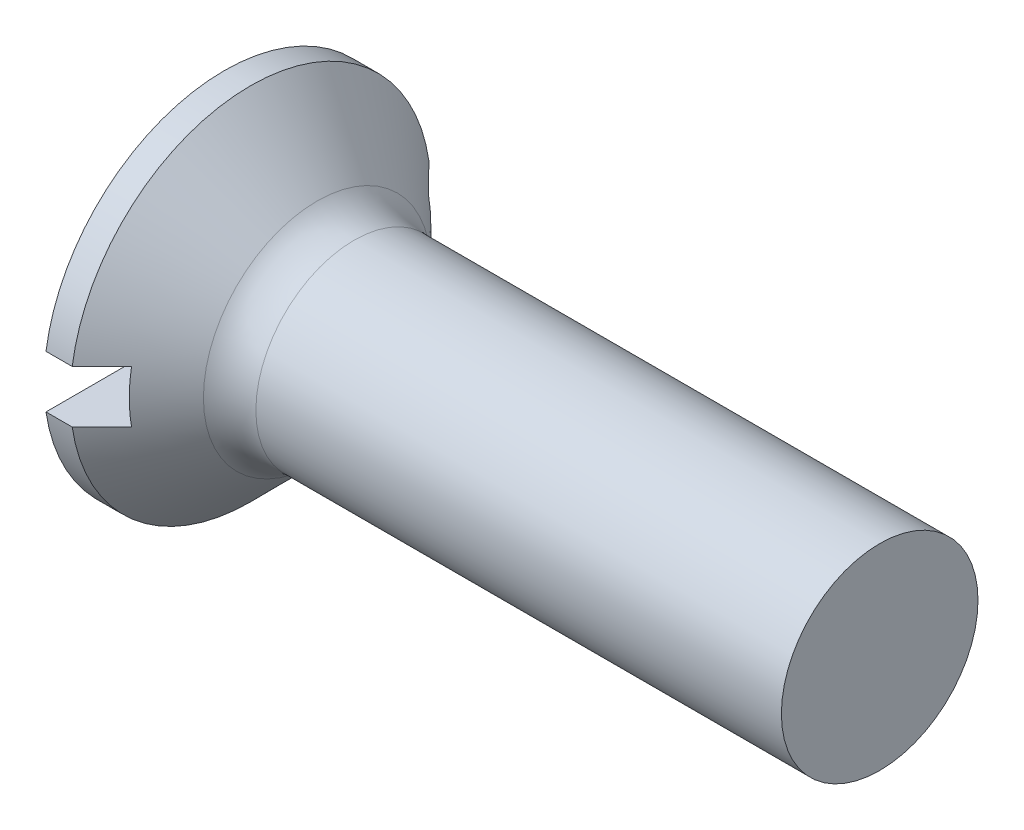
ISO-10303-21;
HEADER;
FILE_DESCRIPTION(('STEP AP214'),'2;1');
FILE_NAME('part.step','',(''),(''),'','','');
FILE_SCHEMA(('AUTOMOTIVE_DESIGN { 1 0 10303 214 1 1 1 1 }'));
ENDSEC;
DATA;
#1=APPLICATION_CONTEXT('core data for automotive mechanical design processes');
#2=APPLICATION_PROTOCOL_DEFINITION('international standard','automotive_design',2000,#1);
#3=PRODUCT_CONTEXT('',#1,'mechanical');
#4=PRODUCT('Part','Part','',(#3));
#5=PRODUCT_RELATED_PRODUCT_CATEGORY('part','',(#4));
#6=PRODUCT_DEFINITION_FORMATION('','',#4);
#7=PRODUCT_DEFINITION_CONTEXT('part definition',#1,'design');
#8=PRODUCT_DEFINITION('design','',#6,#7);
#9=PRODUCT_DEFINITION_SHAPE('','',#8);
#10=(LENGTH_UNIT() NAMED_UNIT(*) SI_UNIT(.MILLI.,.METRE.));
#11=(NAMED_UNIT(*) PLANE_ANGLE_UNIT() SI_UNIT($,.RADIAN.));
#12=(NAMED_UNIT(*) SI_UNIT($,.STERADIAN.) SOLID_ANGLE_UNIT());
#13=UNCERTAINTY_MEASURE_WITH_UNIT(LENGTH_MEASURE(1.E-05),#10,'distance_accuracy_value','');
#14=(GEOMETRIC_REPRESENTATION_CONTEXT(3) GLOBAL_UNCERTAINTY_ASSIGNED_CONTEXT((#13)) GLOBAL_UNIT_ASSIGNED_CONTEXT((#10,
#11,#12)) REPRESENTATION_CONTEXT('',''));
#15=CARTESIAN_POINT('',(0.,0.,0.));
#16=DIRECTION('',(0.,0.,1.));
#17=DIRECTION('',(1.,0.,0.));
#18=AXIS2_PLACEMENT_3D('',#15,#16,#17);
#19=CARTESIAN_POINT('',(-6.34999999999999,0.,0.));
#20=DIRECTION('',(-1.,0.,0.));
#21=DIRECTION('',(0.,0.,1.));
#22=AXIS2_PLACEMENT_3D('',#19,#20,#21);
#23=CYLINDRICAL_SURFACE('',#22,2.75);
#24=DIRECTION('',(-1.,0.,0.));
#25=VECTOR('',#24,1.);
#26=CARTESIAN_POINT('',(-6.34999999999999,0.4,-2.72075357208256));
#27=LINE('',#26,#25);
#28=CARTESIAN_POINT('',(0.,0.4,-2.72075357208256));
#29=VERTEX_POINT('',#28);
#30=CARTESIAN_POINT('',(0.400000000000005,0.4,-2.72075357208256));
#31=VERTEX_POINT('',#30);
#32=EDGE_CURVE('E59',#29,#31,#27,.F.);
#33=ORIENTED_EDGE('',*,*,#32,.F.);
#34=CARTESIAN_POINT('',(0.,0.,0.));
#35=DIRECTION('',(-1.,0.,0.));
#36=DIRECTION('',(0.,0.,1.));
#37=AXIS2_PLACEMENT_3D('',#34,#35,#36);
#38=CIRCLE('',#37,2.75);
#39=CARTESIAN_POINT('',(0.,0.4,2.72075357208256));
#40=VERTEX_POINT('',#39);
#41=EDGE_CURVE('E107',#40,#29,#38,.T.);
#42=ORIENTED_EDGE('',*,*,#41,.F.);
#43=DIRECTION('',(-1.,0.,0.));
#44=VECTOR('',#43,1.);
#45=CARTESIAN_POINT('',(-6.34999999999999,0.4,2.72075357208256));
#46=LINE('',#45,#44);
#47=CARTESIAN_POINT('',(0.400000000000005,0.4,2.72075357208256));
#48=VERTEX_POINT('',#47);
#49=EDGE_CURVE('E164',#48,#40,#46,.T.);
#50=ORIENTED_EDGE('',*,*,#49,.F.);
#51=CARTESIAN_POINT('',(0.400000000000005,0.,0.));
#52=DIRECTION('',(-1.,0.,0.));
#53=DIRECTION('',(0.,0.,1.));
#54=AXIS2_PLACEMENT_3D('',#51,#52,#53);
#55=CIRCLE('',#54,2.75);
#56=EDGE_CURVE('E116',#48,#31,#55,.T.);
#57=ORIENTED_EDGE('',*,*,#56,.T.);
#58=EDGE_LOOP('',(#33,#42,#50,#57));
#59=FACE_BOUND('',#58,.T.);
#60=ADVANCED_FACE('F36',(#59),#23,.T.);
#61=CARTESIAN_POINT('',(0.,0.,0.));
#62=DIRECTION('',(-1.,0.,0.));
#63=DIRECTION('',(0.,0.,1.));
#64=AXIS2_PLACEMENT_3D('',#61,#62,#63);
#65=PLANE('',#64);
#66=DIRECTION('',(0.,0.,-1.));
#67=VECTOR('',#66,1.);
#68=CARTESIAN_POINT('',(0.,0.4,0.));
#69=LINE('',#68,#67);
#70=EDGE_CURVE('E94',#40,#29,#69,.T.);
#71=ORIENTED_EDGE('',*,*,#70,.F.);
#72=ORIENTED_EDGE('',*,*,#41,.T.);
#73=EDGE_LOOP('',(#71,#72));
#74=FACE_BOUND('',#73,.T.);
#75=ADVANCED_FACE('F170',(#74),#65,.T.);
#76=CARTESIAN_POINT('',(10.,1.5,0.));
#77=DIRECTION('',(1.,0.,0.));
#78=DIRECTION('',(0.,0.,-1.));
#79=AXIS2_PLACEMENT_3D('',#76,#77,#78);
#80=PLANE('',#79);
#81=CARTESIAN_POINT('',(10.,0.,0.));
#82=DIRECTION('',(-1.,0.,0.));
#83=DIRECTION('',(0.,0.,1.));
#84=AXIS2_PLACEMENT_3D('',#81,#82,#83);
#85=CIRCLE('',#84,1.5);
#86=CARTESIAN_POINT('',(10.,0.,1.5));
#87=VERTEX_POINT('',#86);
#88=EDGE_CURVE('E117',#87,#87,#85,.T.);
#89=ORIENTED_EDGE('',*,*,#88,.F.);
#90=EDGE_LOOP('',(#89));
#91=FACE_BOUND('',#90,.T.);
#92=ADVANCED_FACE('F172',(#91),#80,.T.);
#93=CARTESIAN_POINT('',(-6.34999999999999,0.,0.));
#94=DIRECTION('',(-1.,0.,0.));
#95=DIRECTION('',(0.,0.,1.));
#96=AXIS2_PLACEMENT_3D('',#93,#94,#95);
#97=CYLINDRICAL_SURFACE('',#96,1.5);
#98=CARTESIAN_POINT('',(1.98137084989848,0.,0.));
#99=DIRECTION('',(-1.,0.,0.));
#100=DIRECTION('',(0.,0.,1.));
#101=AXIS2_PLACEMENT_3D('',#98,#99,#100);
#102=CIRCLE('',#101,1.5);
#103=CARTESIAN_POINT('',(1.98137084989848,0.,1.5));
#104=VERTEX_POINT('',#103);
#105=EDGE_CURVE('E95',#104,#104,#102,.F.);
#106=ORIENTED_EDGE('',*,*,#105,.T.);
#107=EDGE_LOOP('',(#106));
#108=FACE_BOUND('',#107,.T.);
#109=ORIENTED_EDGE('',*,*,#88,.T.);
#110=EDGE_LOOP('',(#109));
#111=FACE_BOUND('',#110,.T.);
#112=ADVANCED_FACE('F177',(#108,#111),#97,.T.);
#113=CARTESIAN_POINT('',(0.400000000000005,0.,0.));
#114=DIRECTION('',(-1.,0.,0.));
#115=DIRECTION('',(0.,0.,1.));
#116=AXIS2_PLACEMENT_3D('',#113,#114,#115);
#117=CONICAL_SURFACE('',#116,2.75,0.78539816339745);
#118=CARTESIAN_POINT('',(-2.91122703099808,0.399999999999999,-6.04801398157296));
#119=CARTESIAN_POINT('',(-2.70333669995712,0.399999999999999,-5.83966573752139));
#120=CARTESIAN_POINT('',(-2.49546630031166,0.399999999999999,-5.63129758737052));
#121=CARTESIAN_POINT('',(-2.07978706521848,0.399999999999999,-5.2144912620075));
#122=CARTESIAN_POINT('',(-1.87197823113852,0.399999999999999,-5.00605308543134));
#123=CARTESIAN_POINT('',(-1.45635477241037,0.399999999999999,-4.58898711382912));
#124=CARTESIAN_POINT('',(-1.2485401909839,0.399999999999999,-4.38035927572767));
#125=CARTESIAN_POINT('',(-0.833054486611349,0.399999999999999,-3.96296915720086));
#126=CARTESIAN_POINT('',(-0.625383360847279,0.399999999999999,-3.75420687958157));
#127=CARTESIAN_POINT('',(-0.208177797150706,0.399999999999999,-3.33435396336398));
#128=CARTESIAN_POINT('',(0.00135434759481753,0.4,-3.12326104596609));
#129=CARTESIAN_POINT('',(0.420030451513073,0.4,-2.70066518043499));
#130=CARTESIAN_POINT('',(0.629174386878202,0.4,-2.48916220868138));
#131=CARTESIAN_POINT('',(0.942224156138593,0.4,-2.1713129981671));
#132=CARTESIAN_POINT('',(1.04644766129475,0.4,-2.06527989301767));
#133=CARTESIAN_POINT('',(1.25455725538018,0.4,-1.85287805131423));
#134=CARTESIAN_POINT('',(1.35844333617521,0.4,-1.7465093067891));
#135=CARTESIAN_POINT('',(1.56564763937195,0.4,-1.53324094855307));
#136=CARTESIAN_POINT('',(1.66896592306241,0.4,-1.42634139460757));
#137=CARTESIAN_POINT('',(1.82313895681254,0.4,-1.26522565766366));
#138=CARTESIAN_POINT('',(1.87439491657569,0.4,-1.21139372905201));
#139=CARTESIAN_POINT('',(1.9765104755376,0.4,-1.10335558747567));
#140=CARTESIAN_POINT('',(2.02737008031461,0.4,-1.04914937979886));
#141=CARTESIAN_POINT('',(2.10536761914265,0.4,-0.965078768929768));
#142=CARTESIAN_POINT('',(2.13272119248435,0.4,-0.935414601324456));
#143=CARTESIAN_POINT('',(2.18719151166742,0.4,-0.875868286782248));
#144=CARTESIAN_POINT('',(2.21430825226833,0.4,-0.845986135048678));
#145=CARTESIAN_POINT('',(2.26822565449431,0.4,-0.785940027475329));
#146=CARTESIAN_POINT('',(2.29502633530682,0.4,-0.755776088943663));
#147=CARTESIAN_POINT('',(2.34818681038839,0.4,-0.695065970456104));
#148=CARTESIAN_POINT('',(2.37454662451584,0.4,-0.664519807826037));
#149=CARTESIAN_POINT('',(2.43976155242959,0.4,-0.587422608894616));
#150=CARTESIAN_POINT('',(2.4782379170761,0.4,-0.540543920717876));
#151=CARTESIAN_POINT('',(2.53401321051795,0.4,-0.468681597610833));
#152=CARTESIAN_POINT('',(2.55228877360357,0.4,-0.444459986191995));
#153=CARTESIAN_POINT('',(2.5878711479654,0.4,-0.39531915610884));
#154=CARTESIAN_POINT('',(2.60517823468484,0.4,-0.370400138848683));
#155=CARTESIAN_POINT('',(2.64157672655789,0.4,-0.314684261327312));
#156=CARTESIAN_POINT('',(2.66036306205222,0.4,-0.28368484243835));
#157=CARTESIAN_POINT('',(2.69440764635418,0.4,-0.219761693796643));
#158=CARTESIAN_POINT('',(2.70967206186428,0.4,-0.186841455937733));
#159=CARTESIAN_POINT('',(2.73016014153724,0.4,-0.129375221596078));
#160=CARTESIAN_POINT('',(2.73703138273339,0.4,-0.105439966049049));
#161=CARTESIAN_POINT('',(2.74668434716516,0.4,-0.0567945818244743));
#162=CARTESIAN_POINT('',(2.74948035548682,0.4,-0.0320874714607019));
#163=CARTESIAN_POINT('',(2.75038742305556,0.4,0.0175418217821301));
#164=CARTESIAN_POINT('',(2.74847509810649,0.4,0.0424644630823507));
#165=CARTESIAN_POINT('',(2.7403655224137,0.4,0.0916234589116821));
#166=CARTESIAN_POINT('',(2.73415677384007,0.4,0.115857789823385));
#167=CARTESIAN_POINT('',(2.71827371927204,0.4,0.164097461973524));
#168=CARTESIAN_POINT('',(2.70848082711735,0.4,0.188061916430982));
#169=CARTESIAN_POINT('',(2.68657810309996,0.4,0.234925488056131));
#170=CARTESIAN_POINT('',(2.67446406551726,0.4,0.257822576152259));
#171=CARTESIAN_POINT('',(2.64859519565537,0.4,0.302903050832693));
#172=CARTESIAN_POINT('',(2.63482775852877,0.4,0.325079071971884));
#173=CARTESIAN_POINT('',(2.60624001527761,0.4,0.368705812927868));
#174=CARTESIAN_POINT('',(2.59142061970022,0.4,0.390157136844758));
#175=CARTESIAN_POINT('',(2.54324495089253,0.4,0.457380684412003));
#176=CARTESIAN_POINT('',(2.5085311578627,0.4,0.502172551984684));
#177=CARTESIAN_POINT('',(2.4373574689067,0.4,0.590355519981424));
#178=CARTESIAN_POINT('',(2.40089644203552,0.4,0.633745681848963));
#179=CARTESIAN_POINT('',(2.32688330317303,0.4,0.719722652435567));
#180=CARTESIAN_POINT('',(2.28932931399318,0.4,0.762307843089061));
#181=CARTESIAN_POINT('',(2.21358878416378,0.4,0.846885546517387));
#182=CARTESIAN_POINT('',(2.17540243181154,0.4,0.888878229061745));
#183=CARTESIAN_POINT('',(2.06044068334854,0.4,1.01402227230979));
#184=CARTESIAN_POINT('',(1.98303698108055,0.4,1.09659540299884));
#185=CARTESIAN_POINT('',(1.82747335677727,0.4,1.26085212091516));
#186=CARTESIAN_POINT('',(1.74931433456999,0.4,1.34253656700302));
#187=CARTESIAN_POINT('',(1.59286602877705,0.4,1.50504082503211));
#188=CARTESIAN_POINT('',(1.51457909296922,0.4,1.58586289734369));
#189=CARTESIAN_POINT('',(1.35769196697884,0.4,1.74720261153539));
#190=CARTESIAN_POINT('',(1.27909177531288,0.4,1.82772025197037));
#191=CARTESIAN_POINT('',(1.04297819662847,0.4,2.06897290850551));
#192=CARTESIAN_POINT('',(0.885154889242076,0.4,2.22940447684664));
#193=CARTESIAN_POINT('',(0.569022750342737,0.4,2.54992542692343));
#194=CARTESIAN_POINT('',(0.410713737476895,0.4,2.71001462943086));
#195=CARTESIAN_POINT('',(0.093846751706257,0.4,3.02994348223417));
#196=CARTESIAN_POINT('',(-0.0647112188507847,0.4,3.18978313485537));
#197=CARTESIAN_POINT('',(-0.540591127347246,0.4,3.66904928426922));
#198=CARTESIAN_POINT('',(-0.858143098403681,0.400000000000001,3.98824727310349));
#199=CARTESIAN_POINT('',(-1.49349686932324,0.400000000000001,4.62632608508985));
#200=CARTESIAN_POINT('',(-1.81129863870678,0.400000000000001,4.94520693861199));
#201=CARTESIAN_POINT('',(-2.25950055023475,0.400000000000001,5.39470040618395));
#202=CARTESIAN_POINT('',(-2.38983276816512,0.400000000000001,5.5253807505132));
#203=CARTESIAN_POINT('',(-2.65051602794782,0.400000000000001,5.78671502436768));
#204=CARTESIAN_POINT('',(-2.78086706913672,0.400000000000001,5.91736895455466));
#205=CARTESIAN_POINT('',(-2.91122703099808,0.400000000000001,6.04801398157296));
#206=B_SPLINE_CURVE_WITH_KNOTS('',3,(#118,#119,#120,#121,#122,#123,#124,#125,#126,#127,#128,
#129,#130,#131,#132,#133,#134,#135,#136,#137,#138,#139,#140,#141,#142,#143,#144,#145,#146,#147,
#148,#149,#150,#151,#152,#153,#154,#155,#156,#157,#158,#159,#160,#161,#162,#163,#164,#165,#166,
#167,#168,#169,#170,#171,#172,#173,#174,#175,#176,#177,#178,#179,#180,#181,#182,#183,#184,#185,
#186,#187,#188,#189,#190,#191,#192,#193,#194,#195,#196,#197,#198,#199,#200,#201,#202,#203,#204,
#205),.UNSPECIFIED.,.F.,.F.,(4,2,2,2,2,2,2,2,2,2,2,2,2,2,2,2,2,2,2,2,2,2,2,2,2,2,2,2,2,2,2,2,2,
2,2,2,2,2,2,2,2,2,2,4),(0.,0.882975910860478,1.76597015363403,2.64937958225391,3.53277113384024,
4.42505762724969,5.31739714423807,5.76343472500757,6.20948297970986,6.65548210253547,
6.87847301535126,7.10146078413753,7.22251193727136,7.34356576218222,7.46461219989591,
7.58565317043343,7.7675312303056,7.85854400270903,7.94953075732351,8.05816632031485,
8.16661019949531,8.24105170239749,8.31523162951187,8.38978071779309,8.46453008531399,
8.54201686233401,8.61964538973785,8.69790858090398,8.77610483669631,8.94600506687254,
9.11601679556836,9.28634010861835,9.45661358569747,9.79613758747497,10.1352975424543,
10.4728599134667,10.8104238848897,11.4855651220709,12.1610000728679,12.8364286918874,
14.1871833908349,15.5377930820782,16.0914848296691,16.6451603543132),.UNSPECIFIED.);
#207=CARTESIAN_POINT('',(0.85,0.4,-2.26495033058123));
#208=VERTEX_POINT('',#207);
#209=EDGE_CURVE('E108',#31,#208,#206,.T.);
#210=ORIENTED_EDGE('',*,*,#209,.F.);
#211=ORIENTED_EDGE('',*,*,#56,.F.);
#212=CARTESIAN_POINT('',(0.85,0.4,2.26495033058123));
#213=VERTEX_POINT('',#212);
#214=EDGE_CURVE('E112',#213,#48,#206,.T.);
#215=ORIENTED_EDGE('',*,*,#214,.F.);
#216=CARTESIAN_POINT('',(0.85,0.,0.));
#217=DIRECTION('',(-1.,0.,0.));
#218=DIRECTION('',(0.,0.,1.));
#219=AXIS2_PLACEMENT_3D('',#216,#217,#218);
#220=CIRCLE('',#219,2.3);
#221=CARTESIAN_POINT('',(0.85,-0.400000000000001,2.26495033058123));
#222=VERTEX_POINT('',#221);
#223=EDGE_CURVE('E40',#213,#222,#220,.F.);
#224=ORIENTED_EDGE('',*,*,#223,.T.);
#225=CARTESIAN_POINT('',(-2.91122703099808,-0.400000000000001,6.04801398157296));
#226=CARTESIAN_POINT('',(-2.70333669995712,-0.400000000000001,5.83966573752139));
#227=CARTESIAN_POINT('',(-2.49546630031166,-0.400000000000001,5.63129758737052));
#228=CARTESIAN_POINT('',(-2.07978706521847,-0.400000000000001,5.2144912620075));
#229=CARTESIAN_POINT('',(-1.87197823113852,-0.400000000000001,5.00605308543134));
#230=CARTESIAN_POINT('',(-1.45635477241037,-0.400000000000001,4.58898711382912));
#231=CARTESIAN_POINT('',(-1.2485401909839,-0.400000000000001,4.38035927572767));
#232=CARTESIAN_POINT('',(-0.833054486611349,-0.400000000000001,3.96296915720086));
#233=CARTESIAN_POINT('',(-0.625383360847279,-0.400000000000001,3.75420687958157));
#234=CARTESIAN_POINT('',(-0.208177797150705,-0.400000000000001,3.33435396336398));
#235=CARTESIAN_POINT('',(0.00135434759481899,-0.400000000000001,3.12326104596609));
#236=CARTESIAN_POINT('',(0.420030451513074,-0.400000000000001,2.70066518043499));
#237=CARTESIAN_POINT('',(0.629174386878203,-0.400000000000001,2.48916220868137));
#238=CARTESIAN_POINT('',(0.942224156138594,-0.400000000000001,2.1713129981671));
#239=CARTESIAN_POINT('',(1.04644766129475,-0.400000000000001,2.06527989301766));
#240=CARTESIAN_POINT('',(1.25455725538018,-0.400000000000001,1.85287805131423));
#241=CARTESIAN_POINT('',(1.35844333617521,-0.400000000000001,1.7465093067891));
#242=CARTESIAN_POINT('',(1.56564763937195,-0.400000000000001,1.53324094855307));
#243=CARTESIAN_POINT('',(1.66896592306241,-0.400000000000001,1.42634139460756));
#244=CARTESIAN_POINT('',(1.82313895681255,-0.400000000000001,1.26522565766366));
#245=CARTESIAN_POINT('',(1.87439491657569,-0.400000000000001,1.211393729052));
#246=CARTESIAN_POINT('',(1.97651047553761,-0.400000000000001,1.10335558747567));
#247=CARTESIAN_POINT('',(2.02737008031461,-0.400000000000001,1.04914937979886));
#248=CARTESIAN_POINT('',(2.10536761914265,-0.400000000000001,0.965078768929766));
#249=CARTESIAN_POINT('',(2.13272119248435,-0.400000000000001,0.935414601324454));
#250=CARTESIAN_POINT('',(2.18719151166742,-0.400000000000001,0.875868286782245));
#251=CARTESIAN_POINT('',(2.21430825226833,-0.400000000000001,0.845986135048675));
#252=CARTESIAN_POINT('',(2.26822565449431,-0.400000000000001,0.785940027475326));
#253=CARTESIAN_POINT('',(2.29502633530682,-0.400000000000001,0.755776088943661));
#254=CARTESIAN_POINT('',(2.3481868103884,-0.400000000000001,0.695065970456102));
#255=CARTESIAN_POINT('',(2.37454662451584,-0.400000000000001,0.664519807826035));
#256=CARTESIAN_POINT('',(2.43976155242959,-0.400000000000001,0.587422608894614));
#257=CARTESIAN_POINT('',(2.4782379170761,-0.400000000000001,0.540543920717874));
#258=CARTESIAN_POINT('',(2.53401321051796,-0.400000000000001,0.468681597610831));
#259=CARTESIAN_POINT('',(2.55228877360357,-0.400000000000001,0.444459986191993));
#260=CARTESIAN_POINT('',(2.5878711479654,-0.400000000000001,0.395319156108837));
#261=CARTESIAN_POINT('',(2.60517823468485,-0.400000000000001,0.37040013884868));
#262=CARTESIAN_POINT('',(2.64157672655789,-0.400000000000001,0.314684261327309));
#263=CARTESIAN_POINT('',(2.66036306205222,-0.400000000000001,0.283684842438347));
#264=CARTESIAN_POINT('',(2.69440764635418,-0.400000000000001,0.219761693796641));
#265=CARTESIAN_POINT('',(2.70967206186428,-0.400000000000001,0.186841455937732));
#266=CARTESIAN_POINT('',(2.73016014153724,-0.400000000000001,0.129375221596077));
#267=CARTESIAN_POINT('',(2.73703138273339,-0.400000000000001,0.105439966049048));
#268=CARTESIAN_POINT('',(2.74668434716516,-0.400000000000001,0.056794581824473));
#269=CARTESIAN_POINT('',(2.74948035548682,-0.400000000000001,0.0320874714607006));
#270=CARTESIAN_POINT('',(2.75038742305555,-0.400000000000001,-0.0175418217821318));
#271=CARTESIAN_POINT('',(2.74847509810649,-0.400000000000001,-0.0424644630823528));
#272=CARTESIAN_POINT('',(2.7403655224137,-0.400000000000001,-0.0916234589116841));
#273=CARTESIAN_POINT('',(2.73415677384007,-0.400000000000001,-0.115857789823386));
#274=CARTESIAN_POINT('',(2.71827371927204,-0.400000000000001,-0.164097461973525));
#275=CARTESIAN_POINT('',(2.70848082711735,-0.400000000000001,-0.188061916430984));
#276=CARTESIAN_POINT('',(2.68657810309996,-0.400000000000001,-0.234925488056133));
#277=CARTESIAN_POINT('',(2.67446406551725,-0.400000000000001,-0.257822576152262));
#278=CARTESIAN_POINT('',(2.64859519565537,-0.400000000000001,-0.302903050832697));
#279=CARTESIAN_POINT('',(2.63482775852876,-0.400000000000001,-0.325079071971888));
#280=CARTESIAN_POINT('',(2.60624001527761,-0.400000000000001,-0.368705812927873));
#281=CARTESIAN_POINT('',(2.59142061970022,-0.400000000000001,-0.390157136844761));
#282=CARTESIAN_POINT('',(2.54324495089253,-0.400000000000001,-0.457380684412007));
#283=CARTESIAN_POINT('',(2.5085311578627,-0.400000000000001,-0.502172551984688));
#284=CARTESIAN_POINT('',(2.43735746890669,-0.400000000000001,-0.590355519981429));
#285=CARTESIAN_POINT('',(2.40089644203552,-0.400000000000001,-0.633745681848969));
#286=CARTESIAN_POINT('',(2.32688330317302,-0.400000000000001,-0.719722652435574));
#287=CARTESIAN_POINT('',(2.28932931399317,-0.400000000000001,-0.762307843089068));
#288=CARTESIAN_POINT('',(2.21358878416377,-0.400000000000001,-0.846885546517395));
#289=CARTESIAN_POINT('',(2.17540243181154,-0.400000000000001,-0.888878229061753));
#290=CARTESIAN_POINT('',(2.06044068334853,-0.400000000000001,-1.01402227230979));
#291=CARTESIAN_POINT('',(1.98303698108054,-0.400000000000001,-1.09659540299885));
#292=CARTESIAN_POINT('',(1.82747335677725,-0.400000000000001,-1.26085212091518));
#293=CARTESIAN_POINT('',(1.74931433456998,-0.400000000000001,-1.34253656700303));
#294=CARTESIAN_POINT('',(1.59286602877704,-0.400000000000001,-1.50504082503213));
#295=CARTESIAN_POINT('',(1.51457909296921,-0.400000000000001,-1.5858628973437));
#296=CARTESIAN_POINT('',(1.35769196697882,-0.400000000000001,-1.74720261153541));
#297=CARTESIAN_POINT('',(1.27909177531287,-0.400000000000001,-1.82772025197039));
#298=CARTESIAN_POINT('',(1.04297819662845,-0.400000000000001,-2.06897290850553));
#299=CARTESIAN_POINT('',(0.885154889242053,-0.400000000000001,-2.22940447684666));
#300=CARTESIAN_POINT('',(0.56902275034271,-0.400000000000001,-2.54992542692346));
#301=CARTESIAN_POINT('',(0.410713737476867,-0.400000000000001,-2.71001462943089));
#302=CARTESIAN_POINT('',(0.0938467517062253,-0.400000000000001,-3.0299434822342));
#303=CARTESIAN_POINT('',(-0.0647112188508182,-0.400000000000001,-3.1897831348554));
#304=CARTESIAN_POINT('',(-0.540591127347285,-0.400000000000001,-3.66904928426926));
#305=CARTESIAN_POINT('',(-0.858143098403724,-0.400000000000001,-3.98824727310353));
#306=CARTESIAN_POINT('',(-1.49349686932329,-0.400000000000001,-4.62632608508989));
#307=CARTESIAN_POINT('',(-1.81129863870683,-0.400000000000001,-4.94520693861204));
#308=CARTESIAN_POINT('',(-2.25950055023479,-0.400000000000001,-5.394700406184));
#309=CARTESIAN_POINT('',(-2.38983276816516,-0.400000000000001,-5.52538075051324));
#310=CARTESIAN_POINT('',(-2.65051602794784,-0.400000000000001,-5.7867150243677));
#311=CARTESIAN_POINT('',(-2.78086706913673,-0.400000000000001,-5.91736895455467));
#312=CARTESIAN_POINT('',(-2.91122703099808,-0.400000000000001,-6.04801398157296));
#313=B_SPLINE_CURVE_WITH_KNOTS('',3,(#225,#226,#227,#228,#229,#230,#231,#232,#233,#234,#235,
#236,#237,#238,#239,#240,#241,#242,#243,#244,#245,#246,#247,#248,#249,#250,#251,#252,#253,#254,
#255,#256,#257,#258,#259,#260,#261,#262,#263,#264,#265,#266,#267,#268,#269,#270,#271,#272,#273,
#274,#275,#276,#277,#278,#279,#280,#281,#282,#283,#284,#285,#286,#287,#288,#289,#290,#291,#292,
#293,#294,#295,#296,#297,#298,#299,#300,#301,#302,#303,#304,#305,#306,#307,#308,#309,#310,#311,
#312),.UNSPECIFIED.,.F.,.F.,(4,2,2,2,2,2,2,2,2,2,2,2,2,2,2,2,2,2,2,2,2,2,2,2,2,2,2,2,2,2,2,2,2,
2,2,2,2,2,2,2,2,2,2,4),(0.,0.882975910860477,1.76597015363403,2.6493795822539,3.53277113384024,
4.42505762724969,5.31739714423807,5.76343472500757,6.20948297970986,6.65548210253547,
6.87847301535126,7.10146078413754,7.22251193727136,7.34356576218222,7.46461219989591,
7.58565317043343,7.7675312303056,7.85854400270903,7.94953075732351,8.05816632031486,
8.16661019949531,8.24105170239749,8.31523162951187,8.38978071779309,8.46453008531399,
8.542016862334,8.61964538973785,8.69790858090398,8.77610483669631,8.94600506687254,
9.11601679556837,9.28634010861835,9.45661358569748,9.79613758747498,10.1352975424543,
10.4728599134667,10.8104238848897,11.4855651220709,12.1610000728679,12.8364286918874,
14.1871833908349,15.5377930820783,16.0914848296691,16.6451603543132),.UNSPECIFIED.);
#314=CARTESIAN_POINT('',(0.400000000000005,-0.400000000000001,2.72075357208256));
#315=VERTEX_POINT('',#314);
#316=EDGE_CURVE('E103',#315,#222,#313,.T.);
#317=ORIENTED_EDGE('',*,*,#316,.F.);
#318=CARTESIAN_POINT('',(0.400000000000005,-0.400000000000001,-2.72075357208256));
#319=VERTEX_POINT('',#318);
#320=EDGE_CURVE('E102',#319,#315,#55,.T.);
#321=ORIENTED_EDGE('',*,*,#320,.F.);
#322=CARTESIAN_POINT('',(0.85,-0.400000000000001,-2.26495033058123));
#323=VERTEX_POINT('',#322);
#324=EDGE_CURVE('E104',#323,#319,#313,.T.);
#325=ORIENTED_EDGE('',*,*,#324,.F.);
#326=EDGE_CURVE('E11',#323,#208,#220,.F.);
#327=ORIENTED_EDGE('',*,*,#326,.T.);
#328=EDGE_LOOP('',(#210,#211,#215,#224,#317,#321,#325,#327));
#329=FACE_BOUND('',#328,.T.);
#330=CARTESIAN_POINT('',(1.41568542494924,0.,0.));
#331=DIRECTION('',(-1.,0.,0.));
#332=DIRECTION('',(0.,0.,1.));
#333=AXIS2_PLACEMENT_3D('',#330,#331,#332);
#334=CIRCLE('',#333,1.73431457505076);
#335=CARTESIAN_POINT('',(1.41568542494924,0.,1.73431457505076));
#336=VERTEX_POINT('',#335);
#337=EDGE_CURVE('E120',#336,#336,#334,.T.);
#338=ORIENTED_EDGE('',*,*,#337,.T.);
#339=EDGE_LOOP('',(#338));
#340=FACE_BOUND('',#339,.T.);
#341=ADVANCED_FACE('F128',(#329,#340),#117,.T.);
#342=DIRECTION('',(-1.,0.,0.));
#343=VECTOR('',#342,1.);
#344=CARTESIAN_POINT('',(-6.34999999999999,-0.400000000000001,2.72075357208256));
#345=LINE('',#344,#343);
#346=CARTESIAN_POINT('',(0.,-0.400000000000001,2.72075357208256));
#347=VERTEX_POINT('',#346);
#348=EDGE_CURVE('E89',#347,#315,#345,.F.);
#349=ORIENTED_EDGE('',*,*,#348,.F.);
#350=CARTESIAN_POINT('',(0.,-0.400000000000001,-2.72075357208256));
#351=VERTEX_POINT('',#350);
#352=EDGE_CURVE('E100',#351,#347,#38,.T.);
#353=ORIENTED_EDGE('',*,*,#352,.F.);
#354=DIRECTION('',(-1.,0.,0.));
#355=VECTOR('',#354,1.);
#356=CARTESIAN_POINT('',(-6.34999999999999,-0.400000000000001,-2.72075357208256));
#357=LINE('',#356,#355);
#358=EDGE_CURVE('E51',#319,#351,#357,.T.);
#359=ORIENTED_EDGE('',*,*,#358,.F.);
#360=ORIENTED_EDGE('',*,*,#320,.T.);
#361=EDGE_LOOP('',(#349,#353,#359,#360));
#362=FACE_BOUND('',#361,.T.);
#363=ADVANCED_FACE('F99',(#362),#23,.T.);
#364=DIRECTION('',(0.,0.,1.));
#365=VECTOR('',#364,1.);
#366=CARTESIAN_POINT('',(0.,-0.400000000000001,0.));
#367=LINE('',#366,#365);
#368=EDGE_CURVE('E86',#351,#347,#367,.T.);
#369=ORIENTED_EDGE('',*,*,#368,.F.);
#370=ORIENTED_EDGE('',*,*,#352,.T.);
#371=EDGE_LOOP('',(#369,#370));
#372=FACE_BOUND('',#371,.T.);
#373=ADVANCED_FACE('F106',(#372),#65,.T.);
#374=CARTESIAN_POINT('',(1.98137084989848,0.,0.));
#375=DIRECTION('',(-1.,0.,0.));
#376=DIRECTION('',(0.,0.,1.));
#377=AXIS2_PLACEMENT_3D('',#374,#375,#376);
#378=TOROIDAL_SURFACE('',#377,2.3,0.8);
#379=ORIENTED_EDGE('',*,*,#105,.F.);
#380=EDGE_LOOP('',(#379));
#381=FACE_BOUND('',#380,.T.);
#382=ORIENTED_EDGE('',*,*,#337,.F.);
#383=EDGE_LOOP('',(#382));
#384=FACE_BOUND('',#383,.T.);
#385=ADVANCED_FACE('F38',(#381,#384),#378,.F.);
#386=CARTESIAN_POINT('',(0.85,0.4,2.75));
#387=DIRECTION('',(0.,1.,0.));
#388=DIRECTION('',(0.,0.,1.));
#389=AXIS2_PLACEMENT_3D('',#386,#387,#388);
#390=PLANE('',#389);
#391=ORIENTED_EDGE('',*,*,#209,.T.);
#392=DIRECTION('',(0.,0.,-1.));
#393=VECTOR('',#392,1.);
#394=CARTESIAN_POINT('',(0.85,0.4,2.75));
#395=LINE('',#394,#393);
#396=EDGE_CURVE('E136',#213,#208,#395,.T.);
#397=ORIENTED_EDGE('',*,*,#396,.F.);
#398=ORIENTED_EDGE('',*,*,#214,.T.);
#399=ORIENTED_EDGE('',*,*,#49,.T.);
#400=ORIENTED_EDGE('',*,*,#70,.T.);
#401=ORIENTED_EDGE('',*,*,#32,.T.);
#402=EDGE_LOOP('',(#391,#397,#398,#399,#400,#401));
#403=FACE_BOUND('',#402,.T.);
#404=ADVANCED_FACE('F139',(#403),#390,.F.);
#405=CARTESIAN_POINT('',(0.85,-0.400000000000001,-2.75));
#406=DIRECTION('',(0.,-1.,0.));
#407=DIRECTION('',(0.,0.,-1.));
#408=AXIS2_PLACEMENT_3D('',#405,#406,#407);
#409=PLANE('',#408);
#410=ORIENTED_EDGE('',*,*,#316,.T.);
#411=DIRECTION('',(0.,0.,1.));
#412=VECTOR('',#411,1.);
#413=CARTESIAN_POINT('',(0.85,-0.400000000000001,-2.75));
#414=LINE('',#413,#412);
#415=EDGE_CURVE('E138',#323,#222,#414,.T.);
#416=ORIENTED_EDGE('',*,*,#415,.F.);
#417=ORIENTED_EDGE('',*,*,#324,.T.);
#418=ORIENTED_EDGE('',*,*,#358,.T.);
#419=ORIENTED_EDGE('',*,*,#368,.T.);
#420=ORIENTED_EDGE('',*,*,#348,.T.);
#421=EDGE_LOOP('',(#410,#416,#417,#418,#419,#420));
#422=FACE_BOUND('',#421,.T.);
#423=ADVANCED_FACE('F88',(#422),#409,.F.);
#424=CARTESIAN_POINT('',(0.85,0.4,-2.75));
#425=DIRECTION('',(-1.,0.,0.));
#426=DIRECTION('',(0.,0.,1.));
#427=AXIS2_PLACEMENT_3D('',#424,#425,#426);
#428=PLANE('',#427);
#429=ORIENTED_EDGE('',*,*,#415,.T.);
#430=ORIENTED_EDGE('',*,*,#223,.F.);
#431=ORIENTED_EDGE('',*,*,#396,.T.);
#432=ORIENTED_EDGE('',*,*,#326,.F.);
#433=EDGE_LOOP('',(#429,#430,#431,#432));
#434=FACE_BOUND('',#433,.T.);
#435=ADVANCED_FACE('F135',(#434),#428,.T.);
#436=CLOSED_SHELL('',(#60,#75,#92,#112,#341,#363,#373,#385,#404,#423,#435));
#437=MANIFOLD_SOLID_BREP('B2',#436);
#438=ADVANCED_BREP_SHAPE_REPRESENTATION('',(#18,#437),#14);
#439=SHAPE_DEFINITION_REPRESENTATION(#9,#438);
ENDSEC;
END-ISO-10303-21;
